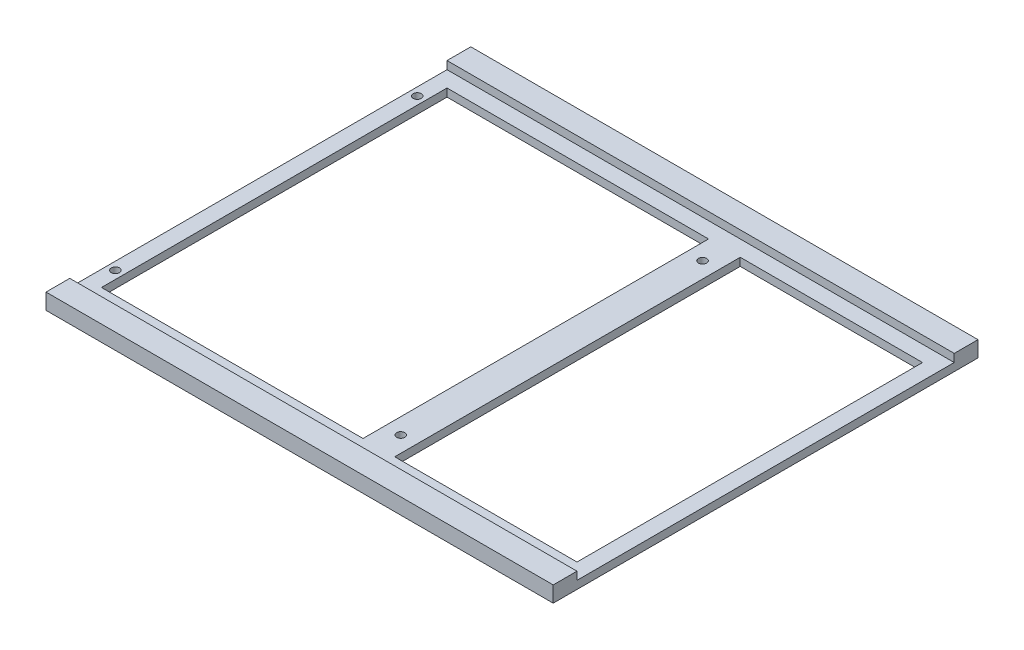
ISO-10303-21;
HEADER;
FILE_DESCRIPTION(('STEP AP214'),'2;1');
FILE_NAME('part.step','',(''),(''),'','','');
FILE_SCHEMA(('AUTOMOTIVE_DESIGN { 1 0 10303 214 1 1 1 1 }'));
ENDSEC;
DATA;
#1=APPLICATION_CONTEXT('core data for automotive mechanical design processes');
#2=APPLICATION_PROTOCOL_DEFINITION('international standard','automotive_design',2000,#1);
#3=PRODUCT_CONTEXT('',#1,'mechanical');
#4=PRODUCT('Part','Part','',(#3));
#5=PRODUCT_RELATED_PRODUCT_CATEGORY('part','',(#4));
#6=PRODUCT_DEFINITION_FORMATION('','',#4);
#7=PRODUCT_DEFINITION_CONTEXT('part definition',#1,'design');
#8=PRODUCT_DEFINITION('design','',#6,#7);
#9=PRODUCT_DEFINITION_SHAPE('','',#8);
#10=(LENGTH_UNIT() NAMED_UNIT(*) SI_UNIT(.MILLI.,.METRE.));
#11=(NAMED_UNIT(*) PLANE_ANGLE_UNIT() SI_UNIT($,.RADIAN.));
#12=(NAMED_UNIT(*) SI_UNIT($,.STERADIAN.) SOLID_ANGLE_UNIT());
#13=UNCERTAINTY_MEASURE_WITH_UNIT(LENGTH_MEASURE(1.E-05),#10,'distance_accuracy_value','');
#14=(GEOMETRIC_REPRESENTATION_CONTEXT(3) GLOBAL_UNCERTAINTY_ASSIGNED_CONTEXT((#13)) GLOBAL_UNIT_ASSIGNED_CONTEXT((#10,
#11,#12)) REPRESENTATION_CONTEXT('',''));
#15=CARTESIAN_POINT('',(0.,0.,0.));
#16=DIRECTION('',(0.,0.,1.));
#17=DIRECTION('',(1.,0.,0.));
#18=AXIS2_PLACEMENT_3D('',#15,#16,#17);
#19=CARTESIAN_POINT('',(0.,0.,0.));
#20=DIRECTION('',(0.,1.,0.));
#21=DIRECTION('',(0.,0.,1.));
#22=AXIS2_PLACEMENT_3D('',#19,#20,#21);
#23=PLANE('',#22);
#24=CARTESIAN_POINT('',(-98.425,0.,60.452));
#25=DIRECTION('',(0.,1.,0.));
#26=DIRECTION('',(0.,0.,1.));
#27=AXIS2_PLACEMENT_3D('',#24,#25,#26);
#28=CIRCLE('',#27,1.64999999999998);
#29=CARTESIAN_POINT('',(-98.425,0.,62.102));
#30=VERTEX_POINT('',#29);
#31=EDGE_CURVE('E38',#30,#30,#28,.T.);
#32=ORIENTED_EDGE('',*,*,#31,.T.);
#33=EDGE_LOOP('',(#32));
#34=FACE_BOUND('',#33,.T.);
#35=CARTESIAN_POINT('',(-98.425,0.,-60.452));
#36=DIRECTION('',(0.,1.,0.));
#37=DIRECTION('',(0.,0.,1.));
#38=AXIS2_PLACEMENT_3D('',#35,#36,#37);
#39=CIRCLE('',#38,1.64999999999998);
#40=CARTESIAN_POINT('',(-98.425,0.,-58.802));
#41=VERTEX_POINT('',#40);
#42=EDGE_CURVE('E512',#41,#41,#39,.T.);
#43=ORIENTED_EDGE('',*,*,#42,.T.);
#44=EDGE_LOOP('',(#43));
#45=FACE_BOUND('',#44,.T.);
#46=CARTESIAN_POINT('',(15.8750000000001,0.,-60.452));
#47=DIRECTION('',(0.,1.,0.));
#48=DIRECTION('',(0.,0.,1.));
#49=AXIS2_PLACEMENT_3D('',#46,#47,#48);
#50=CIRCLE('',#49,1.64999999999999);
#51=CARTESIAN_POINT('',(15.8750000000001,0.,-58.802));
#52=VERTEX_POINT('',#51);
#53=EDGE_CURVE('E521',#52,#52,#50,.T.);
#54=ORIENTED_EDGE('',*,*,#53,.T.);
#55=EDGE_LOOP('',(#54));
#56=FACE_BOUND('',#55,.T.);
#57=CARTESIAN_POINT('',(15.8750000000001,0.,60.452));
#58=DIRECTION('',(0.,1.,0.));
#59=DIRECTION('',(0.,0.,1.));
#60=AXIS2_PLACEMENT_3D('',#57,#58,#59);
#61=CIRCLE('',#60,1.64999999999999);
#62=CARTESIAN_POINT('',(15.8750000000001,0.,62.102));
#63=VERTEX_POINT('',#62);
#64=EDGE_CURVE('E170',#63,#63,#61,.T.);
#65=ORIENTED_EDGE('',*,*,#64,.T.);
#66=EDGE_LOOP('',(#65));
#67=FACE_BOUND('',#66,.T.);
#68=DIRECTION('',(-1.,0.,0.));
#69=VECTOR('',#68,1.);
#70=CARTESIAN_POINT('',(0.,0.,69.215));
#71=LINE('',#70,#69);
#72=CARTESIAN_POINT('',(9.52500000000003,0.,69.215));
#73=VERTEX_POINT('',#72);
#74=CARTESIAN_POINT('',(-95.25,0.,69.215));
#75=VERTEX_POINT('',#74);
#76=EDGE_CURVE('E186',#73,#75,#71,.T.);
#77=ORIENTED_EDGE('',*,*,#76,.F.);
#78=DIRECTION('',(0.,0.,-1.));
#79=VECTOR('',#78,1.);
#80=CARTESIAN_POINT('',(9.52500000000003,0.,0.));
#81=LINE('',#80,#79);
#82=CARTESIAN_POINT('',(9.52500000000002,0.,-69.215));
#83=VERTEX_POINT('',#82);
#84=EDGE_CURVE('E188',#73,#83,#81,.T.);
#85=ORIENTED_EDGE('',*,*,#84,.T.);
#86=DIRECTION('',(-1.,0.,0.));
#87=VECTOR('',#86,1.);
#88=CARTESIAN_POINT('',(0.,0.,-69.215));
#89=LINE('',#88,#87);
#90=CARTESIAN_POINT('',(-95.25,0.,-69.215));
#91=VERTEX_POINT('',#90);
#92=EDGE_CURVE('E192',#83,#91,#89,.T.);
#93=ORIENTED_EDGE('',*,*,#92,.T.);
#94=DIRECTION('',(0.,0.,-1.));
#95=VECTOR('',#94,1.);
#96=CARTESIAN_POINT('',(-95.25,0.,0.));
#97=LINE('',#96,#95);
#98=EDGE_CURVE('E195',#75,#91,#97,.T.);
#99=ORIENTED_EDGE('',*,*,#98,.F.);
#100=EDGE_LOOP('',(#77,#85,#93,#99));
#101=FACE_BOUND('',#100,.T.);
#102=DIRECTION('',(0.,0.,1.));
#103=VECTOR('',#102,1.);
#104=CARTESIAN_POINT('',(-101.6,0.,85.09));
#105=LINE('',#104,#103);
#106=CARTESIAN_POINT('',(-101.6,0.,-85.09));
#107=VERTEX_POINT('',#106);
#108=CARTESIAN_POINT('',(-101.6,0.,85.09));
#109=VERTEX_POINT('',#108);
#110=EDGE_CURVE('E237',#107,#109,#105,.T.);
#111=ORIENTED_EDGE('',*,*,#110,.F.);
#112=DIRECTION('',(-1.,0.,0.));
#113=VECTOR('',#112,1.);
#114=CARTESIAN_POINT('',(101.6,0.,-85.09));
#115=LINE('',#114,#113);
#116=CARTESIAN_POINT('',(101.6,0.,-85.09));
#117=VERTEX_POINT('',#116);
#118=EDGE_CURVE('E263',#117,#107,#115,.T.);
#119=ORIENTED_EDGE('',*,*,#118,.F.);
#120=DIRECTION('',(0.,0.,-1.));
#121=VECTOR('',#120,1.);
#122=CARTESIAN_POINT('',(101.6,0.,85.09));
#123=LINE('',#122,#121);
#124=CARTESIAN_POINT('',(101.6,0.,85.09));
#125=VERTEX_POINT('',#124);
#126=EDGE_CURVE('E261',#125,#117,#123,.T.);
#127=ORIENTED_EDGE('',*,*,#126,.F.);
#128=DIRECTION('',(1.,0.,0.));
#129=VECTOR('',#128,1.);
#130=CARTESIAN_POINT('',(101.6,0.,85.09));
#131=LINE('',#130,#129);
#132=EDGE_CURVE('E259',#109,#125,#131,.T.);
#133=ORIENTED_EDGE('',*,*,#132,.F.);
#134=EDGE_LOOP('',(#111,#119,#127,#133));
#135=FACE_BOUND('',#134,.T.);
#136=DIRECTION('',(0.,0.,-1.));
#137=VECTOR('',#136,1.);
#138=CARTESIAN_POINT('',(22.2250000000001,0.,0.));
#139=LINE('',#138,#137);
#140=CARTESIAN_POINT('',(22.2250000000001,0.,69.215));
#141=VERTEX_POINT('',#140);
#142=CARTESIAN_POINT('',(22.2250000000001,0.,-69.215));
#143=VERTEX_POINT('',#142);
#144=EDGE_CURVE('E156',#141,#143,#139,.T.);
#145=ORIENTED_EDGE('',*,*,#144,.F.);
#146=DIRECTION('',(-1.,0.,0.));
#147=VECTOR('',#146,1.);
#148=CARTESIAN_POINT('',(0.,0.,69.215));
#149=LINE('',#148,#147);
#150=CARTESIAN_POINT('',(95.25,0.,69.215));
#151=VERTEX_POINT('',#150);
#152=EDGE_CURVE('E148',#151,#141,#149,.T.);
#153=ORIENTED_EDGE('',*,*,#152,.F.);
#154=DIRECTION('',(0.,0.,-1.));
#155=VECTOR('',#154,1.);
#156=CARTESIAN_POINT('',(95.25,0.,0.));
#157=LINE('',#156,#155);
#158=CARTESIAN_POINT('',(95.25,0.,-69.215));
#159=VERTEX_POINT('',#158);
#160=EDGE_CURVE('E50',#151,#159,#157,.T.);
#161=ORIENTED_EDGE('',*,*,#160,.T.);
#162=DIRECTION('',(-1.,0.,0.));
#163=VECTOR('',#162,1.);
#164=CARTESIAN_POINT('',(0.,0.,-69.215));
#165=LINE('',#164,#163);
#166=EDGE_CURVE('E160',#159,#143,#165,.T.);
#167=ORIENTED_EDGE('',*,*,#166,.T.);
#168=EDGE_LOOP('',(#145,#153,#161,#167));
#169=FACE_BOUND('',#168,.T.);
#170=ADVANCED_FACE('F34',(#34,#45,#56,#67,#101,#135,#169),#23,.F.);
#171=CARTESIAN_POINT('',(-101.6,3.175,-75.565));
#172=DIRECTION('',(0.,-1.,0.));
#173=DIRECTION('',(0.,0.,-1.));
#174=AXIS2_PLACEMENT_3D('',#171,#172,#173);
#175=PLANE('',#174);
#176=CARTESIAN_POINT('',(-98.425,3.175,60.452));
#177=DIRECTION('',(0.,1.,0.));
#178=DIRECTION('',(0.,0.,1.));
#179=AXIS2_PLACEMENT_3D('',#176,#177,#178);
#180=CIRCLE('',#179,1.64999999999998);
#181=CARTESIAN_POINT('',(-98.425,3.175,62.102));
#182=VERTEX_POINT('',#181);
#183=EDGE_CURVE('E508',#182,#182,#180,.T.);
#184=ORIENTED_EDGE('',*,*,#183,.F.);
#185=EDGE_LOOP('',(#184));
#186=FACE_BOUND('',#185,.T.);
#187=CARTESIAN_POINT('',(-98.425,3.175,-60.452));
#188=DIRECTION('',(0.,1.,0.));
#189=DIRECTION('',(0.,0.,1.));
#190=AXIS2_PLACEMENT_3D('',#187,#188,#189);
#191=CIRCLE('',#190,1.64999999999998);
#192=CARTESIAN_POINT('',(-98.425,3.175,-58.802));
#193=VERTEX_POINT('',#192);
#194=EDGE_CURVE('E510',#193,#193,#191,.T.);
#195=ORIENTED_EDGE('',*,*,#194,.F.);
#196=EDGE_LOOP('',(#195));
#197=FACE_BOUND('',#196,.T.);
#198=CARTESIAN_POINT('',(15.8750000000001,3.175,-60.452));
#199=DIRECTION('',(0.,1.,0.));
#200=DIRECTION('',(0.,0.,1.));
#201=AXIS2_PLACEMENT_3D('',#198,#199,#200);
#202=CIRCLE('',#201,1.64999999999999);
#203=CARTESIAN_POINT('',(15.8750000000001,3.175,-58.802));
#204=VERTEX_POINT('',#203);
#205=EDGE_CURVE('E518',#204,#204,#202,.T.);
#206=ORIENTED_EDGE('',*,*,#205,.F.);
#207=EDGE_LOOP('',(#206));
#208=FACE_BOUND('',#207,.T.);
#209=CARTESIAN_POINT('',(15.8750000000001,3.175,60.452));
#210=DIRECTION('',(0.,1.,0.));
#211=DIRECTION('',(0.,0.,1.));
#212=AXIS2_PLACEMENT_3D('',#209,#210,#211);
#213=CIRCLE('',#212,1.64999999999999);
#214=CARTESIAN_POINT('',(15.8750000000001,3.175,62.102));
#215=VERTEX_POINT('',#214);
#216=EDGE_CURVE('E523',#215,#215,#213,.T.);
#217=ORIENTED_EDGE('',*,*,#216,.F.);
#218=EDGE_LOOP('',(#217));
#219=FACE_BOUND('',#218,.T.);
#220=DIRECTION('',(-1.,0.,0.));
#221=VECTOR('',#220,1.);
#222=CARTESIAN_POINT('',(0.,3.175,69.215));
#223=LINE('',#222,#221);
#224=CARTESIAN_POINT('',(9.52500000000005,3.175,69.215));
#225=VERTEX_POINT('',#224);
#226=CARTESIAN_POINT('',(-95.25,3.175,69.215));
#227=VERTEX_POINT('',#226);
#228=EDGE_CURVE('E182',#225,#227,#223,.T.);
#229=ORIENTED_EDGE('',*,*,#228,.T.);
#230=DIRECTION('',(0.,0.,-1.));
#231=VECTOR('',#230,1.);
#232=CARTESIAN_POINT('',(-95.25,3.175,0.));
#233=LINE('',#232,#231);
#234=CARTESIAN_POINT('',(-95.25,3.175,-69.215));
#235=VERTEX_POINT('',#234);
#236=EDGE_CURVE('E189',#227,#235,#233,.T.);
#237=ORIENTED_EDGE('',*,*,#236,.T.);
#238=DIRECTION('',(-1.,0.,0.));
#239=VECTOR('',#238,1.);
#240=CARTESIAN_POINT('',(0.,3.175,-69.215));
#241=LINE('',#240,#239);
#242=CARTESIAN_POINT('',(9.52500000000003,3.175,-69.215));
#243=VERTEX_POINT('',#242);
#244=EDGE_CURVE('E203',#243,#235,#241,.T.);
#245=ORIENTED_EDGE('',*,*,#244,.F.);
#246=DIRECTION('',(0.,0.,-1.));
#247=VECTOR('',#246,1.);
#248=CARTESIAN_POINT('',(9.52500000000003,3.175,0.));
#249=LINE('',#248,#247);
#250=EDGE_CURVE('E200',#225,#243,#249,.T.);
#251=ORIENTED_EDGE('',*,*,#250,.F.);
#252=EDGE_LOOP('',(#229,#237,#245,#251));
#253=FACE_BOUND('',#252,.T.);
#254=DIRECTION('',(0.,0.,-1.));
#255=VECTOR('',#254,1.);
#256=CARTESIAN_POINT('',(101.6,3.175,-75.565));
#257=LINE('',#256,#255);
#258=CARTESIAN_POINT('',(101.6,3.175,75.565));
#259=VERTEX_POINT('',#258);
#260=CARTESIAN_POINT('',(101.6,3.175,-75.565));
#261=VERTEX_POINT('',#260);
#262=EDGE_CURVE('E231',#259,#261,#257,.T.);
#263=ORIENTED_EDGE('',*,*,#262,.T.);
#264=DIRECTION('',(1.,0.,0.));
#265=VECTOR('',#264,1.);
#266=CARTESIAN_POINT('',(-101.6,3.175,-75.565));
#267=LINE('',#266,#265);
#268=CARTESIAN_POINT('',(-101.6,3.175,-75.565));
#269=VERTEX_POINT('',#268);
#270=EDGE_CURVE('E241',#269,#261,#267,.T.);
#271=ORIENTED_EDGE('',*,*,#270,.F.);
#272=DIRECTION('',(0.,0.,-1.));
#273=VECTOR('',#272,1.);
#274=CARTESIAN_POINT('',(-101.6,3.175,-75.565));
#275=LINE('',#274,#273);
#276=CARTESIAN_POINT('',(-101.6,3.175,75.565));
#277=VERTEX_POINT('',#276);
#278=EDGE_CURVE('E221',#277,#269,#275,.T.);
#279=ORIENTED_EDGE('',*,*,#278,.F.);
#280=DIRECTION('',(1.,0.,0.));
#281=VECTOR('',#280,1.);
#282=CARTESIAN_POINT('',(-101.6,3.175,75.565));
#283=LINE('',#282,#281);
#284=EDGE_CURVE('E228',#277,#259,#283,.T.);
#285=ORIENTED_EDGE('',*,*,#284,.T.);
#286=EDGE_LOOP('',(#263,#271,#279,#285));
#287=FACE_BOUND('',#286,.T.);
#288=DIRECTION('',(0.,0.,-1.));
#289=VECTOR('',#288,1.);
#290=CARTESIAN_POINT('',(22.2250000000001,3.175,0.));
#291=LINE('',#290,#289);
#292=CARTESIAN_POINT('',(22.2250000000001,3.175,69.215));
#293=VERTEX_POINT('',#292);
#294=CARTESIAN_POINT('',(22.2250000000001,3.175,-69.215));
#295=VERTEX_POINT('',#294);
#296=EDGE_CURVE('E58',#293,#295,#291,.T.);
#297=ORIENTED_EDGE('',*,*,#296,.T.);
#298=DIRECTION('',(-1.,0.,0.));
#299=VECTOR('',#298,1.);
#300=CARTESIAN_POINT('',(0.,3.175,-69.215));
#301=LINE('',#300,#299);
#302=CARTESIAN_POINT('',(95.25,3.175,-69.215));
#303=VERTEX_POINT('',#302);
#304=EDGE_CURVE('E164',#303,#295,#301,.T.);
#305=ORIENTED_EDGE('',*,*,#304,.F.);
#306=DIRECTION('',(0.,0.,-1.));
#307=VECTOR('',#306,1.);
#308=CARTESIAN_POINT('',(95.25,3.175,0.));
#309=LINE('',#308,#307);
#310=CARTESIAN_POINT('',(95.25,3.175,69.215));
#311=VERTEX_POINT('',#310);
#312=EDGE_CURVE('E167',#311,#303,#309,.T.);
#313=ORIENTED_EDGE('',*,*,#312,.F.);
#314=DIRECTION('',(-1.,0.,0.));
#315=VECTOR('',#314,1.);
#316=CARTESIAN_POINT('',(0.,3.175,69.215));
#317=LINE('',#316,#315);
#318=EDGE_CURVE('E176',#311,#293,#317,.T.);
#319=ORIENTED_EDGE('',*,*,#318,.T.);
#320=EDGE_LOOP('',(#297,#305,#313,#319));
#321=FACE_BOUND('',#320,.T.);
#322=ADVANCED_FACE('F301',(#186,#197,#208,#219,#253,#287,#321),#175,.F.);
#323=CARTESIAN_POINT('',(0.,6.35,0.));
#324=DIRECTION('',(0.,1.,0.));
#325=DIRECTION('',(0.,0.,1.));
#326=AXIS2_PLACEMENT_3D('',#323,#324,#325);
#327=PLANE('',#326);
#328=DIRECTION('',(1.,0.,0.));
#329=VECTOR('',#328,1.);
#330=CARTESIAN_POINT('',(-101.6,6.35,75.565));
#331=LINE('',#330,#329);
#332=CARTESIAN_POINT('',(-101.6,6.35,75.565));
#333=VERTEX_POINT('',#332);
#334=CARTESIAN_POINT('',(101.6,6.35,75.565));
#335=VERTEX_POINT('',#334);
#336=EDGE_CURVE('E235',#333,#335,#331,.T.);
#337=ORIENTED_EDGE('',*,*,#336,.F.);
#338=DIRECTION('',(0.,0.,1.));
#339=VECTOR('',#338,1.);
#340=CARTESIAN_POINT('',(-101.6,6.35,85.09));
#341=LINE('',#340,#339);
#342=CARTESIAN_POINT('',(-101.6,6.35,85.09));
#343=VERTEX_POINT('',#342);
#344=EDGE_CURVE('E248',#333,#343,#341,.T.);
#345=ORIENTED_EDGE('',*,*,#344,.T.);
#346=DIRECTION('',(1.,0.,0.));
#347=VECTOR('',#346,1.);
#348=CARTESIAN_POINT('',(101.6,6.35,85.09));
#349=LINE('',#348,#347);
#350=CARTESIAN_POINT('',(101.6,6.35,85.09));
#351=VERTEX_POINT('',#350);
#352=EDGE_CURVE('E247',#343,#351,#349,.T.);
#353=ORIENTED_EDGE('',*,*,#352,.T.);
#354=DIRECTION('',(0.,0.,-1.));
#355=VECTOR('',#354,1.);
#356=CARTESIAN_POINT('',(101.6,6.35,85.09));
#357=LINE('',#356,#355);
#358=EDGE_CURVE('E251',#351,#335,#357,.T.);
#359=ORIENTED_EDGE('',*,*,#358,.T.);
#360=EDGE_LOOP('',(#337,#345,#353,#359));
#361=FACE_BOUND('',#360,.T.);
#362=ADVANCED_FACE('F307',(#361),#327,.T.);
#363=CARTESIAN_POINT('',(-101.6,6.35,85.09));
#364=DIRECTION('',(1.,0.,0.));
#365=DIRECTION('',(0.,0.,-1.));
#366=AXIS2_PLACEMENT_3D('',#363,#364,#365);
#367=PLANE('',#366);
#368=ORIENTED_EDGE('',*,*,#344,.F.);
#369=DIRECTION('',(0.,-1.,0.));
#370=VECTOR('',#369,1.);
#371=CARTESIAN_POINT('',(-101.6,3.175,75.565));
#372=LINE('',#371,#370);
#373=EDGE_CURVE('E218',#333,#277,#372,.T.);
#374=ORIENTED_EDGE('',*,*,#373,.T.);
#375=ORIENTED_EDGE('',*,*,#278,.T.);
#376=DIRECTION('',(0.,1.,0.));
#377=VECTOR('',#376,1.);
#378=CARTESIAN_POINT('',(-101.6,3.175,-75.565));
#379=LINE('',#378,#377);
#380=CARTESIAN_POINT('',(-101.6,6.35,-75.565));
#381=VERTEX_POINT('',#380);
#382=EDGE_CURVE('E225',#269,#381,#379,.T.);
#383=ORIENTED_EDGE('',*,*,#382,.T.);
#384=CARTESIAN_POINT('',(-101.6,6.35,-85.09));
#385=VERTEX_POINT('',#384);
#386=EDGE_CURVE('E244',#385,#381,#341,.T.);
#387=ORIENTED_EDGE('',*,*,#386,.F.);
#388=DIRECTION('',(0.,-1.,0.));
#389=VECTOR('',#388,1.);
#390=CARTESIAN_POINT('',(-101.6,6.35,-85.09));
#391=LINE('',#390,#389);
#392=EDGE_CURVE('E256',#385,#107,#391,.T.);
#393=ORIENTED_EDGE('',*,*,#392,.T.);
#394=ORIENTED_EDGE('',*,*,#110,.T.);
#395=DIRECTION('',(0.,-1.,0.));
#396=VECTOR('',#395,1.);
#397=CARTESIAN_POINT('',(-101.6,6.35,85.09));
#398=LINE('',#397,#396);
#399=EDGE_CURVE('E11',#343,#109,#398,.T.);
#400=ORIENTED_EDGE('',*,*,#399,.F.);
#401=EDGE_LOOP('',(#368,#374,#375,#383,#387,#393,#394,#400));
#402=FACE_BOUND('',#401,.T.);
#403=ADVANCED_FACE('F36',(#402),#367,.F.);
#404=CARTESIAN_POINT('',(101.6,6.35,85.09));
#405=DIRECTION('',(0.,0.,-1.));
#406=DIRECTION('',(-1.,0.,0.));
#407=AXIS2_PLACEMENT_3D('',#404,#405,#406);
#408=PLANE('',#407);
#409=ORIENTED_EDGE('',*,*,#132,.T.);
#410=DIRECTION('',(0.,-1.,0.));
#411=VECTOR('',#410,1.);
#412=CARTESIAN_POINT('',(101.6,6.35,85.09));
#413=LINE('',#412,#411);
#414=EDGE_CURVE('E43',#351,#125,#413,.T.);
#415=ORIENTED_EDGE('',*,*,#414,.F.);
#416=ORIENTED_EDGE('',*,*,#352,.F.);
#417=ORIENTED_EDGE('',*,*,#399,.T.);
#418=EDGE_LOOP('',(#409,#415,#416,#417));
#419=FACE_BOUND('',#418,.T.);
#420=ADVANCED_FACE('F308',(#419),#408,.F.);
#421=CARTESIAN_POINT('',(101.6,6.35,85.09));
#422=DIRECTION('',(-1.,0.,0.));
#423=DIRECTION('',(0.,0.,1.));
#424=AXIS2_PLACEMENT_3D('',#421,#422,#423);
#425=PLANE('',#424);
#426=ORIENTED_EDGE('',*,*,#262,.F.);
#427=DIRECTION('',(0.,-1.,0.));
#428=VECTOR('',#427,1.);
#429=CARTESIAN_POINT('',(101.6,3.175,75.565));
#430=LINE('',#429,#428);
#431=EDGE_CURVE('E211',#335,#259,#430,.T.);
#432=ORIENTED_EDGE('',*,*,#431,.F.);
#433=ORIENTED_EDGE('',*,*,#358,.F.);
#434=ORIENTED_EDGE('',*,*,#414,.T.);
#435=ORIENTED_EDGE('',*,*,#126,.T.);
#436=DIRECTION('',(0.,-1.,0.));
#437=VECTOR('',#436,1.);
#438=CARTESIAN_POINT('',(101.6,6.35,-85.09));
#439=LINE('',#438,#437);
#440=CARTESIAN_POINT('',(101.6,6.35,-85.09));
#441=VERTEX_POINT('',#440);
#442=EDGE_CURVE('E267',#441,#117,#439,.T.);
#443=ORIENTED_EDGE('',*,*,#442,.F.);
#444=CARTESIAN_POINT('',(101.6,6.35,-75.565));
#445=VERTEX_POINT('',#444);
#446=EDGE_CURVE('E250',#445,#441,#357,.T.);
#447=ORIENTED_EDGE('',*,*,#446,.F.);
#448=DIRECTION('',(0.,1.,0.));
#449=VECTOR('',#448,1.);
#450=CARTESIAN_POINT('',(101.6,3.175,-75.565));
#451=LINE('',#450,#449);
#452=EDGE_CURVE('E222',#261,#445,#451,.T.);
#453=ORIENTED_EDGE('',*,*,#452,.F.);
#454=EDGE_LOOP('',(#426,#432,#433,#434,#435,#443,#447,#453));
#455=FACE_BOUND('',#454,.T.);
#456=ADVANCED_FACE('F276',(#455),#425,.F.);
#457=CARTESIAN_POINT('',(101.6,6.35,-85.09));
#458=DIRECTION('',(0.,0.,1.));
#459=DIRECTION('',(1.,0.,0.));
#460=AXIS2_PLACEMENT_3D('',#457,#458,#459);
#461=PLANE('',#460);
#462=ORIENTED_EDGE('',*,*,#118,.T.);
#463=ORIENTED_EDGE('',*,*,#392,.F.);
#464=DIRECTION('',(-1.,0.,0.));
#465=VECTOR('',#464,1.);
#466=CARTESIAN_POINT('',(101.6,6.35,-85.09));
#467=LINE('',#466,#465);
#468=EDGE_CURVE('E254',#441,#385,#467,.T.);
#469=ORIENTED_EDGE('',*,*,#468,.F.);
#470=ORIENTED_EDGE('',*,*,#442,.T.);
#471=EDGE_LOOP('',(#462,#463,#469,#470));
#472=FACE_BOUND('',#471,.T.);
#473=ADVANCED_FACE('F286',(#472),#461,.F.);
#474=DIRECTION('',(1.,0.,0.));
#475=VECTOR('',#474,1.);
#476=CARTESIAN_POINT('',(-101.6,6.35,-75.565));
#477=LINE('',#476,#475);
#478=EDGE_CURVE('E238',#381,#445,#477,.T.);
#479=ORIENTED_EDGE('',*,*,#478,.T.);
#480=ORIENTED_EDGE('',*,*,#446,.T.);
#481=ORIENTED_EDGE('',*,*,#468,.T.);
#482=ORIENTED_EDGE('',*,*,#386,.T.);
#483=EDGE_LOOP('',(#479,#480,#481,#482));
#484=FACE_BOUND('',#483,.T.);
#485=ADVANCED_FACE('F294',(#484),#327,.T.);
#486=CARTESIAN_POINT('',(-101.6,3.175,75.565));
#487=DIRECTION('',(0.,0.,1.));
#488=DIRECTION('',(1.,0.,0.));
#489=AXIS2_PLACEMENT_3D('',#486,#487,#488);
#490=PLANE('',#489);
#491=ORIENTED_EDGE('',*,*,#431,.T.);
#492=ORIENTED_EDGE('',*,*,#284,.F.);
#493=ORIENTED_EDGE('',*,*,#373,.F.);
#494=ORIENTED_EDGE('',*,*,#336,.T.);
#495=EDGE_LOOP('',(#491,#492,#493,#494));
#496=FACE_BOUND('',#495,.T.);
#497=ADVANCED_FACE('F304',(#496),#490,.F.);
#498=CARTESIAN_POINT('',(-101.6,3.175,-75.565));
#499=DIRECTION('',(0.,0.,-1.));
#500=DIRECTION('',(0.,1.,0.));
#501=AXIS2_PLACEMENT_3D('',#498,#499,#500);
#502=PLANE('',#501);
#503=ORIENTED_EDGE('',*,*,#452,.T.);
#504=ORIENTED_EDGE('',*,*,#478,.F.);
#505=ORIENTED_EDGE('',*,*,#382,.F.);
#506=ORIENTED_EDGE('',*,*,#270,.T.);
#507=EDGE_LOOP('',(#503,#504,#505,#506));
#508=FACE_BOUND('',#507,.T.);
#509=ADVANCED_FACE('F298',(#508),#502,.F.);
#510=CARTESIAN_POINT('',(0.,0.,69.215));
#511=DIRECTION('',(0.,0.,-1.));
#512=DIRECTION('',(-1.,0.,0.));
#513=AXIS2_PLACEMENT_3D('',#510,#511,#512);
#514=PLANE('',#513);
#515=ORIENTED_EDGE('',*,*,#228,.F.);
#516=DIRECTION('',(0.,1.,0.));
#517=VECTOR('',#516,1.);
#518=CARTESIAN_POINT('',(9.52500000000003,0.,69.215));
#519=LINE('',#518,#517);
#520=EDGE_CURVE('E197',#73,#225,#519,.T.);
#521=ORIENTED_EDGE('',*,*,#520,.F.);
#522=ORIENTED_EDGE('',*,*,#76,.T.);
#523=DIRECTION('',(0.,1.,0.));
#524=VECTOR('',#523,1.);
#525=CARTESIAN_POINT('',(-95.25,0.,69.215));
#526=LINE('',#525,#524);
#527=EDGE_CURVE('E208',#75,#227,#526,.T.);
#528=ORIENTED_EDGE('',*,*,#527,.T.);
#529=EDGE_LOOP('',(#515,#521,#522,#528));
#530=FACE_BOUND('',#529,.T.);
#531=ADVANCED_FACE('F371',(#530),#514,.T.);
#532=CARTESIAN_POINT('',(-95.25,0.,0.));
#533=DIRECTION('',(1.,0.,0.));
#534=DIRECTION('',(0.,0.,-1.));
#535=AXIS2_PLACEMENT_3D('',#532,#533,#534);
#536=PLANE('',#535);
#537=ORIENTED_EDGE('',*,*,#236,.F.);
#538=ORIENTED_EDGE('',*,*,#527,.F.);
#539=ORIENTED_EDGE('',*,*,#98,.T.);
#540=DIRECTION('',(0.,1.,0.));
#541=VECTOR('',#540,1.);
#542=CARTESIAN_POINT('',(-95.25,0.,-69.215));
#543=LINE('',#542,#541);
#544=EDGE_CURVE('E212',#91,#235,#543,.T.);
#545=ORIENTED_EDGE('',*,*,#544,.T.);
#546=EDGE_LOOP('',(#537,#538,#539,#545));
#547=FACE_BOUND('',#546,.T.);
#548=ADVANCED_FACE('F381',(#547),#536,.T.);
#549=CARTESIAN_POINT('',(0.,0.,-69.215));
#550=DIRECTION('',(0.,0.,-1.));
#551=DIRECTION('',(-1.,0.,0.));
#552=AXIS2_PLACEMENT_3D('',#549,#550,#551);
#553=PLANE('',#552);
#554=ORIENTED_EDGE('',*,*,#244,.T.);
#555=ORIENTED_EDGE('',*,*,#544,.F.);
#556=ORIENTED_EDGE('',*,*,#92,.F.);
#557=DIRECTION('',(0.,1.,0.));
#558=VECTOR('',#557,1.);
#559=CARTESIAN_POINT('',(9.52500000000003,0.,-69.215));
#560=LINE('',#559,#558);
#561=EDGE_CURVE('E214',#83,#243,#560,.T.);
#562=ORIENTED_EDGE('',*,*,#561,.T.);
#563=EDGE_LOOP('',(#554,#555,#556,#562));
#564=FACE_BOUND('',#563,.T.);
#565=ADVANCED_FACE('F392',(#564),#553,.F.);
#566=CARTESIAN_POINT('',(9.52500000000003,0.,0.));
#567=DIRECTION('',(1.,0.,0.));
#568=DIRECTION('',(0.,0.,-1.));
#569=AXIS2_PLACEMENT_3D('',#566,#567,#568);
#570=PLANE('',#569);
#571=ORIENTED_EDGE('',*,*,#250,.T.);
#572=ORIENTED_EDGE('',*,*,#561,.F.);
#573=ORIENTED_EDGE('',*,*,#84,.F.);
#574=ORIENTED_EDGE('',*,*,#520,.T.);
#575=EDGE_LOOP('',(#571,#572,#573,#574));
#576=FACE_BOUND('',#575,.T.);
#577=ADVANCED_FACE('F402',(#576),#570,.F.);
#578=CARTESIAN_POINT('',(22.2250000000001,0.,0.));
#579=DIRECTION('',(1.,0.,0.));
#580=DIRECTION('',(0.,0.,-1.));
#581=AXIS2_PLACEMENT_3D('',#578,#579,#580);
#582=PLANE('',#581);
#583=ORIENTED_EDGE('',*,*,#296,.F.);
#584=DIRECTION('',(0.,1.,0.));
#585=VECTOR('',#584,1.);
#586=CARTESIAN_POINT('',(22.2250000000001,0.,69.215));
#587=LINE('',#586,#585);
#588=EDGE_CURVE('E151',#141,#293,#587,.T.);
#589=ORIENTED_EDGE('',*,*,#588,.F.);
#590=ORIENTED_EDGE('',*,*,#144,.T.);
#591=DIRECTION('',(0.,1.,0.));
#592=VECTOR('',#591,1.);
#593=CARTESIAN_POINT('',(22.2250000000001,0.,-69.215));
#594=LINE('',#593,#592);
#595=EDGE_CURVE('E180',#143,#295,#594,.T.);
#596=ORIENTED_EDGE('',*,*,#595,.T.);
#597=EDGE_LOOP('',(#583,#589,#590,#596));
#598=FACE_BOUND('',#597,.T.);
#599=ADVANCED_FACE('F158',(#598),#582,.T.);
#600=CARTESIAN_POINT('',(0.,0.,-69.215));
#601=DIRECTION('',(0.,0.,-1.));
#602=DIRECTION('',(-1.,0.,0.));
#603=AXIS2_PLACEMENT_3D('',#600,#601,#602);
#604=PLANE('',#603);
#605=ORIENTED_EDGE('',*,*,#304,.T.);
#606=ORIENTED_EDGE('',*,*,#595,.F.);
#607=ORIENTED_EDGE('',*,*,#166,.F.);
#608=DIRECTION('',(0.,1.,0.));
#609=VECTOR('',#608,1.);
#610=CARTESIAN_POINT('',(95.25,0.,-69.215));
#611=LINE('',#610,#609);
#612=EDGE_CURVE('E183',#159,#303,#611,.T.);
#613=ORIENTED_EDGE('',*,*,#612,.T.);
#614=EDGE_LOOP('',(#605,#606,#607,#613));
#615=FACE_BOUND('',#614,.T.);
#616=ADVANCED_FACE('F421',(#615),#604,.F.);
#617=CARTESIAN_POINT('',(95.25,0.,0.));
#618=DIRECTION('',(1.,0.,0.));
#619=DIRECTION('',(0.,0.,-1.));
#620=AXIS2_PLACEMENT_3D('',#617,#618,#619);
#621=PLANE('',#620);
#622=ORIENTED_EDGE('',*,*,#312,.T.);
#623=ORIENTED_EDGE('',*,*,#612,.F.);
#624=ORIENTED_EDGE('',*,*,#160,.F.);
#625=DIRECTION('',(0.,1.,0.));
#626=VECTOR('',#625,1.);
#627=CARTESIAN_POINT('',(95.25,0.,69.215));
#628=LINE('',#627,#626);
#629=EDGE_CURVE('E153',#151,#311,#628,.T.);
#630=ORIENTED_EDGE('',*,*,#629,.T.);
#631=EDGE_LOOP('',(#622,#623,#624,#630));
#632=FACE_BOUND('',#631,.T.);
#633=ADVANCED_FACE('F430',(#632),#621,.F.);
#634=CARTESIAN_POINT('',(0.,0.,69.215));
#635=DIRECTION('',(0.,0.,-1.));
#636=DIRECTION('',(-1.,0.,0.));
#637=AXIS2_PLACEMENT_3D('',#634,#635,#636);
#638=PLANE('',#637);
#639=ORIENTED_EDGE('',*,*,#318,.F.);
#640=ORIENTED_EDGE('',*,*,#629,.F.);
#641=ORIENTED_EDGE('',*,*,#152,.T.);
#642=ORIENTED_EDGE('',*,*,#588,.T.);
#643=EDGE_LOOP('',(#639,#640,#641,#642));
#644=FACE_BOUND('',#643,.T.);
#645=ADVANCED_FACE('F150',(#644),#638,.T.);
#646=CARTESIAN_POINT('',(15.8750000000001,3.175,60.452));
#647=DIRECTION('',(0.,1.,0.));
#648=DIRECTION('',(0.,0.,1.));
#649=AXIS2_PLACEMENT_3D('',#646,#647,#648);
#650=CYLINDRICAL_SURFACE('',#649,1.64999999999999);
#651=ORIENTED_EDGE('',*,*,#216,.T.);
#652=EDGE_LOOP('',(#651));
#653=FACE_BOUND('',#652,.T.);
#654=ORIENTED_EDGE('',*,*,#64,.F.);
#655=EDGE_LOOP('',(#654));
#656=FACE_BOUND('',#655,.T.);
#657=ADVANCED_FACE('F447',(#653,#656),#650,.F.);
#658=CARTESIAN_POINT('',(15.8750000000001,3.175,-60.452));
#659=DIRECTION('',(0.,1.,0.));
#660=DIRECTION('',(0.,0.,1.));
#661=AXIS2_PLACEMENT_3D('',#658,#659,#660);
#662=CYLINDRICAL_SURFACE('',#661,1.64999999999999);
#663=ORIENTED_EDGE('',*,*,#205,.T.);
#664=EDGE_LOOP('',(#663));
#665=FACE_BOUND('',#664,.T.);
#666=ORIENTED_EDGE('',*,*,#53,.F.);
#667=EDGE_LOOP('',(#666));
#668=FACE_BOUND('',#667,.T.);
#669=ADVANCED_FACE('F464',(#665,#668),#662,.F.);
#670=CARTESIAN_POINT('',(-98.425,3.175,-60.452));
#671=DIRECTION('',(0.,1.,0.));
#672=DIRECTION('',(0.,0.,1.));
#673=AXIS2_PLACEMENT_3D('',#670,#671,#672);
#674=CYLINDRICAL_SURFACE('',#673,1.64999999999998);
#675=ORIENTED_EDGE('',*,*,#194,.T.);
#676=EDGE_LOOP('',(#675));
#677=FACE_BOUND('',#676,.T.);
#678=ORIENTED_EDGE('',*,*,#42,.F.);
#679=EDGE_LOOP('',(#678));
#680=FACE_BOUND('',#679,.T.);
#681=ADVANCED_FACE('F475',(#677,#680),#674,.F.);
#682=CARTESIAN_POINT('',(-98.425,3.175,60.452));
#683=DIRECTION('',(0.,1.,0.));
#684=DIRECTION('',(0.,0.,1.));
#685=AXIS2_PLACEMENT_3D('',#682,#683,#684);
#686=CYLINDRICAL_SURFACE('',#685,1.64999999999998);
#687=ORIENTED_EDGE('',*,*,#183,.T.);
#688=EDGE_LOOP('',(#687));
#689=FACE_BOUND('',#688,.T.);
#690=ORIENTED_EDGE('',*,*,#31,.F.);
#691=EDGE_LOOP('',(#690));
#692=FACE_BOUND('',#691,.T.);
#693=ADVANCED_FACE('F486',(#689,#692),#686,.F.);
#694=CLOSED_SHELL('',(#170,#322,#362,#403,#420,#456,#473,#485,#497,#509,#531,#548,#565,#577,
#599,#616,#633,#645,#657,#669,#681,#693));
#695=MANIFOLD_SOLID_BREP('B2',#694);
#696=ADVANCED_BREP_SHAPE_REPRESENTATION('',(#18,#695),#14);
#697=SHAPE_DEFINITION_REPRESENTATION(#9,#696);
ENDSEC;
END-ISO-10303-21;
